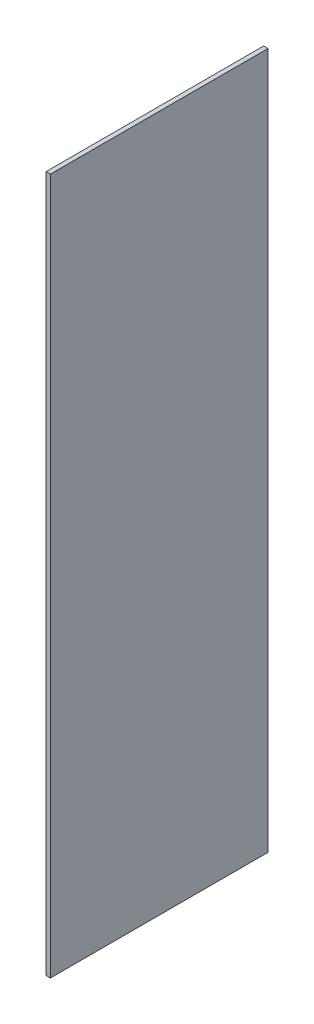
ISO-10303-21;
HEADER;
FILE_DESCRIPTION(('STEP AP214'),'2;1');
FILE_NAME('part.step','',(''),(''),'','','');
FILE_SCHEMA(('AUTOMOTIVE_DESIGN { 1 0 10303 214 1 1 1 1 }'));
ENDSEC;
DATA;
#1=APPLICATION_CONTEXT('core data for automotive mechanical design processes');
#2=APPLICATION_PROTOCOL_DEFINITION('international standard','automotive_design',2000,#1);
#3=PRODUCT_CONTEXT('',#1,'mechanical');
#4=PRODUCT('Part','Part','',(#3));
#5=PRODUCT_RELATED_PRODUCT_CATEGORY('part','',(#4));
#6=PRODUCT_DEFINITION_FORMATION('','',#4);
#7=PRODUCT_DEFINITION_CONTEXT('part definition',#1,'design');
#8=PRODUCT_DEFINITION('design','',#6,#7);
#9=PRODUCT_DEFINITION_SHAPE('','',#8);
#10=(LENGTH_UNIT() NAMED_UNIT(*) SI_UNIT(.MILLI.,.METRE.));
#11=(NAMED_UNIT(*) PLANE_ANGLE_UNIT() SI_UNIT($,.RADIAN.));
#12=(NAMED_UNIT(*) SI_UNIT($,.STERADIAN.) SOLID_ANGLE_UNIT());
#13=UNCERTAINTY_MEASURE_WITH_UNIT(LENGTH_MEASURE(1.E-05),#10,'distance_accuracy_value','');
#14=(GEOMETRIC_REPRESENTATION_CONTEXT(3) GLOBAL_UNCERTAINTY_ASSIGNED_CONTEXT((#13)) GLOBAL_UNIT_ASSIGNED_CONTEXT((#10,
#11,#12)) REPRESENTATION_CONTEXT('',''));
#15=CARTESIAN_POINT('',(0.,0.,0.));
#16=DIRECTION('',(0.,0.,1.));
#17=DIRECTION('',(1.,0.,0.));
#18=AXIS2_PLACEMENT_3D('',#15,#16,#17);
#19=CARTESIAN_POINT('',(0.,0.,5.));
#20=DIRECTION('',(1.,0.,0.));
#21=DIRECTION('',(0.,0.,-1.));
#22=AXIS2_PLACEMENT_3D('',#19,#20,#21);
#23=PLANE('',#22);
#24=DIRECTION('',(0.,-1.,0.));
#25=VECTOR('',#24,1.);
#26=CARTESIAN_POINT('',(0.,0.,0.));
#27=LINE('',#26,#25);
#28=CARTESIAN_POINT('',(0.,16.,0.));
#29=VERTEX_POINT('',#28);
#30=CARTESIAN_POINT('',(0.,0.,0.));
#31=VERTEX_POINT('',#30);
#32=EDGE_CURVE('E96',#29,#31,#27,.T.);
#33=ORIENTED_EDGE('',*,*,#32,.T.);
#34=DIRECTION('',(0.,0.,-1.));
#35=VECTOR('',#34,1.);
#36=CARTESIAN_POINT('',(0.,0.,5.));
#37=LINE('',#36,#35);
#38=CARTESIAN_POINT('',(0.,0.,5.));
#39=VERTEX_POINT('',#38);
#40=EDGE_CURVE('E11',#39,#31,#37,.T.);
#41=ORIENTED_EDGE('',*,*,#40,.F.);
#42=DIRECTION('',(0.,-1.,0.));
#43=VECTOR('',#42,1.);
#44=CARTESIAN_POINT('',(0.,0.,5.));
#45=LINE('',#44,#43);
#46=CARTESIAN_POINT('',(0.,16.,5.));
#47=VERTEX_POINT('',#46);
#48=EDGE_CURVE('E84',#47,#39,#45,.T.);
#49=ORIENTED_EDGE('',*,*,#48,.F.);
#50=DIRECTION('',(0.,0.,-1.));
#51=VECTOR('',#50,1.);
#52=CARTESIAN_POINT('',(0.,16.,5.));
#53=LINE('',#52,#51);
#54=EDGE_CURVE('E92',#47,#29,#53,.T.);
#55=ORIENTED_EDGE('',*,*,#54,.T.);
#56=EDGE_LOOP('',(#33,#41,#49,#55));
#57=FACE_BOUND('',#56,.T.);
#58=ADVANCED_FACE('F33',(#57),#23,.F.);
#59=CARTESIAN_POINT('',(0.,0.,5.));
#60=DIRECTION('',(0.,1.,0.));
#61=DIRECTION('',(0.,0.,1.));
#62=AXIS2_PLACEMENT_3D('',#59,#60,#61);
#63=PLANE('',#62);
#64=DIRECTION('',(1.,0.,0.));
#65=VECTOR('',#64,1.);
#66=CARTESIAN_POINT('',(0.,0.,0.));
#67=LINE('',#66,#65);
#68=CARTESIAN_POINT('',(0.0999999999999998,0.,0.));
#69=VERTEX_POINT('',#68);
#70=EDGE_CURVE('E88',#31,#69,#67,.T.);
#71=ORIENTED_EDGE('',*,*,#70,.T.);
#72=DIRECTION('',(0.,0.,-1.));
#73=VECTOR('',#72,1.);
#74=CARTESIAN_POINT('',(0.0999999999999998,0.,5.));
#75=LINE('',#74,#73);
#76=CARTESIAN_POINT('',(0.0999999999999998,0.,5.));
#77=VERTEX_POINT('',#76);
#78=EDGE_CURVE('E41',#77,#69,#75,.T.);
#79=ORIENTED_EDGE('',*,*,#78,.F.);
#80=DIRECTION('',(1.,0.,0.));
#81=VECTOR('',#80,1.);
#82=CARTESIAN_POINT('',(0.,0.,5.));
#83=LINE('',#82,#81);
#84=EDGE_CURVE('E79',#39,#77,#83,.T.);
#85=ORIENTED_EDGE('',*,*,#84,.F.);
#86=ORIENTED_EDGE('',*,*,#40,.T.);
#87=EDGE_LOOP('',(#71,#79,#85,#86));
#88=FACE_BOUND('',#87,.T.);
#89=ADVANCED_FACE('F87',(#88),#63,.F.);
#90=CARTESIAN_POINT('',(0.0999999999999998,0.,5.));
#91=DIRECTION('',(-1.,0.,0.));
#92=DIRECTION('',(0.,-1.,0.));
#93=AXIS2_PLACEMENT_3D('',#90,#91,#92);
#94=PLANE('',#93);
#95=DIRECTION('',(0.,1.,0.));
#96=VECTOR('',#95,1.);
#97=CARTESIAN_POINT('',(0.0999999999999998,0.,0.));
#98=LINE('',#97,#96);
#99=CARTESIAN_POINT('',(0.1,16.,0.));
#100=VERTEX_POINT('',#99);
#101=EDGE_CURVE('E66',#69,#100,#98,.T.);
#102=ORIENTED_EDGE('',*,*,#101,.T.);
#103=DIRECTION('',(0.,0.,-1.));
#104=VECTOR('',#103,1.);
#105=CARTESIAN_POINT('',(0.1,16.,5.));
#106=LINE('',#105,#104);
#107=CARTESIAN_POINT('',(0.1,16.,5.));
#108=VERTEX_POINT('',#107);
#109=EDGE_CURVE('E89',#108,#100,#106,.T.);
#110=ORIENTED_EDGE('',*,*,#109,.F.);
#111=DIRECTION('',(0.,1.,0.));
#112=VECTOR('',#111,1.);
#113=CARTESIAN_POINT('',(0.0999999999999998,0.,5.));
#114=LINE('',#113,#112);
#115=EDGE_CURVE('E82',#77,#108,#114,.T.);
#116=ORIENTED_EDGE('',*,*,#115,.F.);
#117=ORIENTED_EDGE('',*,*,#78,.T.);
#118=EDGE_LOOP('',(#102,#110,#116,#117));
#119=FACE_BOUND('',#118,.T.);
#120=ADVANCED_FACE('F90',(#119),#94,.F.);
#121=CARTESIAN_POINT('',(0.,16.,5.));
#122=DIRECTION('',(0.,-1.,0.));
#123=DIRECTION('',(0.,0.,-1.));
#124=AXIS2_PLACEMENT_3D('',#121,#122,#123);
#125=PLANE('',#124);
#126=DIRECTION('',(-1.,0.,0.));
#127=VECTOR('',#126,1.);
#128=CARTESIAN_POINT('',(0.,16.,0.));
#129=LINE('',#128,#127);
#130=EDGE_CURVE('E72',#100,#29,#129,.T.);
#131=ORIENTED_EDGE('',*,*,#130,.T.);
#132=ORIENTED_EDGE('',*,*,#54,.F.);
#133=DIRECTION('',(-1.,0.,0.));
#134=VECTOR('',#133,1.);
#135=CARTESIAN_POINT('',(0.,16.,5.));
#136=LINE('',#135,#134);
#137=EDGE_CURVE('E49',#108,#47,#136,.T.);
#138=ORIENTED_EDGE('',*,*,#137,.F.);
#139=ORIENTED_EDGE('',*,*,#109,.T.);
#140=EDGE_LOOP('',(#131,#132,#138,#139));
#141=FACE_BOUND('',#140,.T.);
#142=ADVANCED_FACE('F103',(#141),#125,.F.);
#143=CARTESIAN_POINT('',(0.,0.,5.));
#144=DIRECTION('',(0.,0.,-1.));
#145=DIRECTION('',(-1.,0.,0.));
#146=AXIS2_PLACEMENT_3D('',#143,#144,#145);
#147=PLANE('',#146);
#148=ORIENTED_EDGE('',*,*,#48,.T.);
#149=ORIENTED_EDGE('',*,*,#84,.T.);
#150=ORIENTED_EDGE('',*,*,#115,.T.);
#151=ORIENTED_EDGE('',*,*,#137,.T.);
#152=EDGE_LOOP('',(#148,#149,#150,#151));
#153=FACE_BOUND('',#152,.T.);
#154=ADVANCED_FACE('F80',(#153),#147,.F.);
#155=CARTESIAN_POINT('',(0.,0.,0.));
#156=DIRECTION('',(0.,0.,-1.));
#157=DIRECTION('',(-1.,0.,0.));
#158=AXIS2_PLACEMENT_3D('',#155,#156,#157);
#159=PLANE('',#158);
#160=ORIENTED_EDGE('',*,*,#32,.F.);
#161=ORIENTED_EDGE('',*,*,#130,.F.);
#162=ORIENTED_EDGE('',*,*,#101,.F.);
#163=ORIENTED_EDGE('',*,*,#70,.F.);
#164=EDGE_LOOP('',(#160,#161,#162,#163));
#165=FACE_BOUND('',#164,.T.);
#166=ADVANCED_FACE('F106',(#165),#159,.T.);
#167=CLOSED_SHELL('',(#58,#89,#120,#142,#154,#166));
#168=MANIFOLD_SOLID_BREP('B2',#167);
#169=ADVANCED_BREP_SHAPE_REPRESENTATION('',(#18,#168),#14);
#170=SHAPE_DEFINITION_REPRESENTATION(#9,#169);
ENDSEC;
END-ISO-10303-21;
